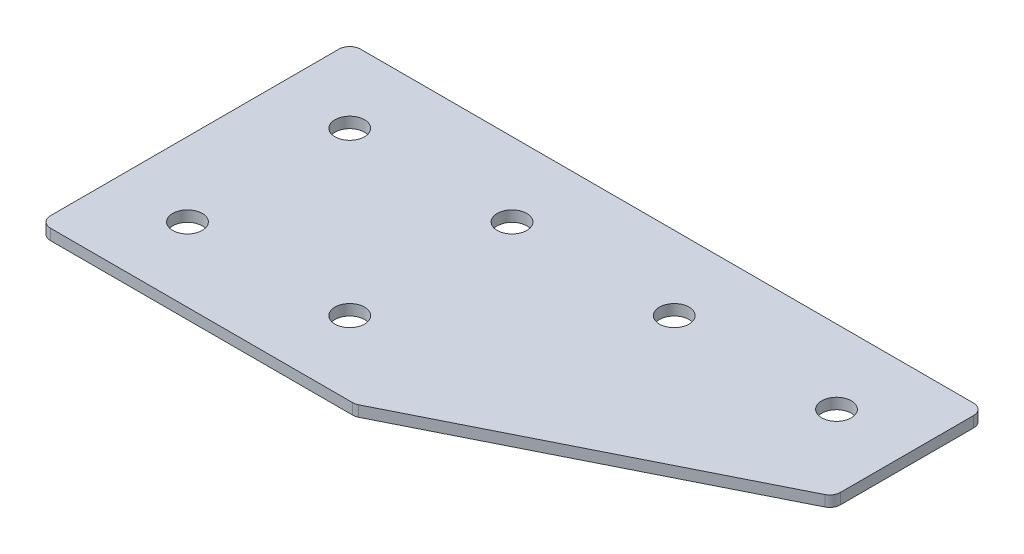
ISO-10303-21;
HEADER;
FILE_DESCRIPTION(('STEP AP214'),'2;1');
FILE_NAME('part.step','',(''),(''),'','','');
FILE_SCHEMA(('AUTOMOTIVE_DESIGN { 1 0 10303 214 1 1 1 1 }'));
ENDSEC;
DATA;
#1=APPLICATION_CONTEXT('core data for automotive mechanical design processes');
#2=APPLICATION_PROTOCOL_DEFINITION('international standard','automotive_design',2000,#1);
#3=PRODUCT_CONTEXT('',#1,'mechanical');
#4=PRODUCT('Part','Part','',(#3));
#5=PRODUCT_RELATED_PRODUCT_CATEGORY('part','',(#4));
#6=PRODUCT_DEFINITION_FORMATION('','',#4);
#7=PRODUCT_DEFINITION_CONTEXT('part definition',#1,'design');
#8=PRODUCT_DEFINITION('design','',#6,#7);
#9=PRODUCT_DEFINITION_SHAPE('','',#8);
#10=(LENGTH_UNIT() NAMED_UNIT(*) SI_UNIT(.MILLI.,.METRE.));
#11=(NAMED_UNIT(*) PLANE_ANGLE_UNIT() SI_UNIT($,.RADIAN.));
#12=(NAMED_UNIT(*) SI_UNIT($,.STERADIAN.) SOLID_ANGLE_UNIT());
#13=UNCERTAINTY_MEASURE_WITH_UNIT(LENGTH_MEASURE(1.E-05),#10,'distance_accuracy_value','');
#14=(GEOMETRIC_REPRESENTATION_CONTEXT(3) GLOBAL_UNCERTAINTY_ASSIGNED_CONTEXT((#13)) GLOBAL_UNIT_ASSIGNED_CONTEXT((#10,
#11,#12)) REPRESENTATION_CONTEXT('',''));
#15=CARTESIAN_POINT('',(0.,0.,0.));
#16=DIRECTION('',(0.,0.,1.));
#17=DIRECTION('',(1.,0.,0.));
#18=AXIS2_PLACEMENT_3D('',#15,#16,#17);
#19=CARTESIAN_POINT('',(-46.5618146076689,1.42462627726309,-23.8623363744272));
#20=DIRECTION('',(0.,-1.,0.));
#21=DIRECTION('',(0.,0.,-1.));
#22=AXIS2_PLACEMENT_3D('',#19,#20,#21);
#23=PLANE('',#22);
#24=CARTESIAN_POINT('',(-24.0618146076689,1.42462627726309,21.1376636255728));
#25=DIRECTION('',(0.,1.,0.));
#26=DIRECTION('',(0.,0.,1.));
#27=AXIS2_PLACEMENT_3D('',#24,#25,#26);
#28=CIRCLE('',#27,4.1);
#29=CARTESIAN_POINT('',(-24.0618146076689,1.42462627726309,25.2376636255728));
#30=VERTEX_POINT('',#29);
#31=EDGE_CURVE('E251',#30,#30,#28,.T.);
#32=ORIENTED_EDGE('',*,*,#31,.T.);
#33=EDGE_LOOP('',(#32));
#34=FACE_BOUND('',#33,.T.);
#35=CARTESIAN_POINT('',(-69.0618146076689,1.42462627726309,21.1376636255728));
#36=DIRECTION('',(0.,1.,0.));
#37=DIRECTION('',(0.,0.,1.));
#38=AXIS2_PLACEMENT_3D('',#35,#36,#37);
#39=CIRCLE('',#38,4.1);
#40=CARTESIAN_POINT('',(-69.0618146076689,1.42462627726309,25.2376636255728));
#41=VERTEX_POINT('',#40);
#42=EDGE_CURVE('E259',#41,#41,#39,.T.);
#43=ORIENTED_EDGE('',*,*,#42,.T.);
#44=EDGE_LOOP('',(#43));
#45=FACE_BOUND('',#44,.T.);
#46=CARTESIAN_POINT('',(65.9381853923311,1.42462627726309,-23.8623363744272));
#47=DIRECTION('',(0.,1.,0.));
#48=DIRECTION('',(0.,0.,1.));
#49=AXIS2_PLACEMENT_3D('',#46,#47,#48);
#50=CIRCLE('',#49,4.1);
#51=CARTESIAN_POINT('',(65.9381853923311,1.42462627726309,-19.7623363744272));
#52=VERTEX_POINT('',#51);
#53=EDGE_CURVE('E265',#52,#52,#50,.T.);
#54=ORIENTED_EDGE('',*,*,#53,.T.);
#55=EDGE_LOOP('',(#54));
#56=FACE_BOUND('',#55,.T.);
#57=CARTESIAN_POINT('',(20.9381853923311,1.42462627726309,-23.8623363744272));
#58=DIRECTION('',(0.,1.,0.));
#59=DIRECTION('',(0.,0.,1.));
#60=AXIS2_PLACEMENT_3D('',#57,#58,#59);
#61=CIRCLE('',#60,4.09999999999999);
#62=CARTESIAN_POINT('',(20.9381853923311,1.42462627726309,-19.7623363744273));
#63=VERTEX_POINT('',#62);
#64=EDGE_CURVE('E271',#63,#63,#61,.T.);
#65=ORIENTED_EDGE('',*,*,#64,.T.);
#66=EDGE_LOOP('',(#65));
#67=FACE_BOUND('',#66,.T.);
#68=CARTESIAN_POINT('',(-24.0618146076689,1.42462627726309,-23.8623363744272));
#69=DIRECTION('',(0.,1.,0.));
#70=DIRECTION('',(0.,0.,1.));
#71=AXIS2_PLACEMENT_3D('',#68,#69,#70);
#72=CIRCLE('',#71,4.1);
#73=CARTESIAN_POINT('',(-24.0618146076689,1.42462627726309,-19.7623363744272));
#74=VERTEX_POINT('',#73);
#75=EDGE_CURVE('E277',#74,#74,#72,.T.);
#76=ORIENTED_EDGE('',*,*,#75,.T.);
#77=EDGE_LOOP('',(#76));
#78=FACE_BOUND('',#77,.T.);
#79=CARTESIAN_POINT('',(-69.0618146076689,1.42462627726309,-23.8623363744272));
#80=DIRECTION('',(0.,1.,0.));
#81=DIRECTION('',(0.,0.,1.));
#82=AXIS2_PLACEMENT_3D('',#79,#80,#81);
#83=CIRCLE('',#82,4.1);
#84=CARTESIAN_POINT('',(-69.0618146076689,1.42462627726309,-19.7623363744272));
#85=VERTEX_POINT('',#84);
#86=EDGE_CURVE('E175',#85,#85,#83,.T.);
#87=ORIENTED_EDGE('',*,*,#86,.T.);
#88=EDGE_LOOP('',(#87));
#89=FACE_BOUND('',#88,.T.);
#90=DIRECTION('',(1.,0.,0.));
#91=VECTOR('',#90,1.);
#92=CARTESIAN_POINT('',(-89.561814607669,1.42462627726309,41.6376636255727));
#93=LINE('',#92,#91);
#94=CARTESIAN_POINT('',(-86.561814607669,1.42462627726309,41.6376636255727));
#95=VERTEX_POINT('',#94);
#96=CARTESIAN_POINT('',(-2.74215449516777,1.42462627726309,41.6376636255727));
#97=VERTEX_POINT('',#96);
#98=EDGE_CURVE('E121',#95,#97,#93,.T.);
#99=ORIENTED_EDGE('',*,*,#98,.F.);
#100=CARTESIAN_POINT('',(-86.561814607669,1.42462627726309,38.6376636255727));
#101=DIRECTION('',(0.,-1.,0.));
#102=DIRECTION('',(0.,0.,-1.));
#103=AXIS2_PLACEMENT_3D('',#100,#101,#102);
#104=CIRCLE('',#103,3.);
#105=CARTESIAN_POINT('',(-89.561814607669,1.42462627726309,38.6376636255727));
#106=VERTEX_POINT('',#105);
#107=EDGE_CURVE('E145',#95,#106,#104,.T.);
#108=ORIENTED_EDGE('',*,*,#107,.T.);
#109=DIRECTION('',(0.,0.,1.));
#110=VECTOR('',#109,1.);
#111=CARTESIAN_POINT('',(-89.561814607669,1.42462627726309,-44.3623363744273));
#112=LINE('',#111,#110);
#113=CARTESIAN_POINT('',(-89.561814607669,1.42462627726309,-41.3623363744273));
#114=VERTEX_POINT('',#113);
#115=EDGE_CURVE('E162',#114,#106,#112,.T.);
#116=ORIENTED_EDGE('',*,*,#115,.F.);
#117=CARTESIAN_POINT('',(-86.561814607669,1.42462627726309,-41.3623363744273));
#118=DIRECTION('',(0.,-1.,0.));
#119=DIRECTION('',(0.,0.,-1.));
#120=AXIS2_PLACEMENT_3D('',#117,#118,#119);
#121=CIRCLE('',#120,3.);
#122=CARTESIAN_POINT('',(-86.561814607669,1.42462627726309,-44.3623363744273));
#123=VERTEX_POINT('',#122);
#124=EDGE_CURVE('E117',#114,#123,#121,.T.);
#125=ORIENTED_EDGE('',*,*,#124,.T.);
#126=DIRECTION('',(-1.,0.,0.));
#127=VECTOR('',#126,1.);
#128=CARTESIAN_POINT('',(86.438185392331,1.42462627726309,-44.3623363744273));
#129=LINE('',#128,#127);
#130=CARTESIAN_POINT('',(83.438185392331,1.42462627726309,-44.3623363744273));
#131=VERTEX_POINT('',#130);
#132=EDGE_CURVE('E160',#131,#123,#129,.T.);
#133=ORIENTED_EDGE('',*,*,#132,.F.);
#134=CARTESIAN_POINT('',(83.438185392331,1.42462627726309,-41.3623363744273));
#135=DIRECTION('',(0.,-1.,0.));
#136=DIRECTION('',(0.,0.,-1.));
#137=AXIS2_PLACEMENT_3D('',#134,#135,#136);
#138=CIRCLE('',#137,3.);
#139=CARTESIAN_POINT('',(86.438185392331,1.42462627726309,-41.3623363744273));
#140=VERTEX_POINT('',#139);
#141=EDGE_CURVE('E140',#131,#140,#138,.T.);
#142=ORIENTED_EDGE('',*,*,#141,.T.);
#143=DIRECTION('',(0.,0.,-1.));
#144=VECTOR('',#143,1.);
#145=CARTESIAN_POINT('',(86.438185392331,1.42462627726309,-2.59840435192698));
#146=LINE('',#145,#144);
#147=CARTESIAN_POINT('',(86.438185392331,1.42462627726309,-4.45250631817667));
#148=VERTEX_POINT('',#147);
#149=EDGE_CURVE('E163',#148,#140,#146,.T.);
#150=ORIENTED_EDGE('',*,*,#149,.F.);
#151=CARTESIAN_POINT('',(83.438185392331,1.42462627726309,-4.45250631817667));
#152=DIRECTION('',(0.,-1.,0.));
#153=DIRECTION('',(0.,0.,-1.));
#154=AXIS2_PLACEMENT_3D('',#151,#152,#153);
#155=CIRCLE('',#154,3.);
#156=CARTESIAN_POINT('',(84.7798261788308,1.42462627726309,-1.76922474517691));
#157=VERTEX_POINT('',#156);
#158=EDGE_CURVE('E31',#148,#157,#155,.T.);
#159=ORIENTED_EDGE('',*,*,#158,.T.);
#160=DIRECTION('',(0.894427190999916,0.,-0.447213595499958));
#161=VECTOR('',#160,1.);
#162=CARTESIAN_POINT('',(-2.0339505626684,1.42462627726309,41.6376636255727));
#163=LINE('',#162,#161);
#164=CARTESIAN_POINT('',(-1.40051370866789,1.42462627726309,41.3209451985725));
#165=VERTEX_POINT('',#164);
#166=EDGE_CURVE('E118',#165,#157,#163,.T.);
#167=ORIENTED_EDGE('',*,*,#166,.F.);
#168=CARTESIAN_POINT('',(-2.74215449516777,1.42462627726309,38.6376636255727));
#169=DIRECTION('',(0.,-1.,0.));
#170=DIRECTION('',(0.,0.,-1.));
#171=AXIS2_PLACEMENT_3D('',#168,#169,#170);
#172=CIRCLE('',#171,3.);
#173=EDGE_CURVE('E143',#165,#97,#172,.T.);
#174=ORIENTED_EDGE('',*,*,#173,.T.);
#175=EDGE_LOOP('',(#99,#108,#116,#125,#133,#142,#150,#159,#167,#174));
#176=FACE_BOUND('',#175,.T.);
#177=ADVANCED_FACE('F16',(#34,#45,#56,#67,#78,#89,#176),#23,.T.);
#178=CARTESIAN_POINT('',(86.438185392331,1.42462627726309,-2.59840435192698));
#179=DIRECTION('',(1.,0.,0.));
#180=DIRECTION('',(0.,0.,-1.));
#181=AXIS2_PLACEMENT_3D('',#178,#179,#180);
#182=PLANE('',#181);
#183=DIRECTION('',(0.,0.,-1.));
#184=VECTOR('',#183,1.);
#185=CARTESIAN_POINT('',(86.438185392331,4.42462627726309,-2.59840435192698));
#186=LINE('',#185,#184);
#187=CARTESIAN_POINT('',(86.438185392331,4.42462627726309,-4.45250631817667));
#188=VERTEX_POINT('',#187);
#189=CARTESIAN_POINT('',(86.438185392331,4.42462627726309,-41.3623363744273));
#190=VERTEX_POINT('',#189);
#191=EDGE_CURVE('E172',#188,#190,#186,.T.);
#192=ORIENTED_EDGE('',*,*,#191,.F.);
#193=DIRECTION('',(0.,1.,0.));
#194=VECTOR('',#193,1.);
#195=CARTESIAN_POINT('',(86.438185392331,1.42462627726309,-4.45250631817667));
#196=LINE('',#195,#194);
#197=EDGE_CURVE('E154',#188,#148,#196,.F.);
#198=ORIENTED_EDGE('',*,*,#197,.T.);
#199=ORIENTED_EDGE('',*,*,#149,.T.);
#200=DIRECTION('',(0.,1.,0.));
#201=VECTOR('',#200,1.);
#202=CARTESIAN_POINT('',(86.438185392331,1.42462627726309,-41.3623363744273));
#203=LINE('',#202,#201);
#204=EDGE_CURVE('E151',#140,#190,#203,.T.);
#205=ORIENTED_EDGE('',*,*,#204,.T.);
#206=EDGE_LOOP('',(#192,#198,#199,#205));
#207=FACE_BOUND('',#206,.T.);
#208=ADVANCED_FACE('F206',(#207),#182,.T.);
#209=CARTESIAN_POINT('',(-2.0339505626684,1.42462627726309,41.6376636255727));
#210=DIRECTION('',(0.447213595499958,0.,0.894427190999916));
#211=DIRECTION('',(0.894427190999916,0.,-0.447213595499958));
#212=AXIS2_PLACEMENT_3D('',#209,#210,#211);
#213=PLANE('',#212);
#214=DIRECTION('',(0.894427190999916,0.,-0.447213595499958));
#215=VECTOR('',#214,1.);
#216=CARTESIAN_POINT('',(-2.0339505626684,4.42462627726309,41.6376636255727));
#217=LINE('',#216,#215);
#218=CARTESIAN_POINT('',(-1.40051370866789,4.42462627726309,41.3209451985725));
#219=VERTEX_POINT('',#218);
#220=CARTESIAN_POINT('',(84.7798261788308,4.42462627726309,-1.76922474517691));
#221=VERTEX_POINT('',#220);
#222=EDGE_CURVE('E124',#219,#221,#217,.T.);
#223=ORIENTED_EDGE('',*,*,#222,.F.);
#224=DIRECTION('',(0.,1.,0.));
#225=VECTOR('',#224,1.);
#226=CARTESIAN_POINT('',(-1.40051370866789,1.42462627726309,41.3209451985725));
#227=LINE('',#226,#225);
#228=EDGE_CURVE('E38',#219,#165,#227,.F.);
#229=ORIENTED_EDGE('',*,*,#228,.T.);
#230=ORIENTED_EDGE('',*,*,#166,.T.);
#231=DIRECTION('',(0.,1.,0.));
#232=VECTOR('',#231,1.);
#233=CARTESIAN_POINT('',(84.7798261788308,1.42462627726309,-1.76922474517692));
#234=LINE('',#233,#232);
#235=EDGE_CURVE('E147',#157,#221,#234,.T.);
#236=ORIENTED_EDGE('',*,*,#235,.T.);
#237=EDGE_LOOP('',(#223,#229,#230,#236));
#238=FACE_BOUND('',#237,.T.);
#239=ADVANCED_FACE('F180',(#238),#213,.T.);
#240=CARTESIAN_POINT('',(-89.561814607669,1.42462627726309,41.6376636255727));
#241=DIRECTION('',(0.,0.,1.));
#242=DIRECTION('',(1.,0.,0.));
#243=AXIS2_PLACEMENT_3D('',#240,#241,#242);
#244=PLANE('',#243);
#245=DIRECTION('',(1.,0.,0.));
#246=VECTOR('',#245,1.);
#247=CARTESIAN_POINT('',(-89.561814607669,4.42462627726309,41.6376636255727));
#248=LINE('',#247,#246);
#249=CARTESIAN_POINT('',(-86.561814607669,4.42462627726309,41.6376636255727));
#250=VERTEX_POINT('',#249);
#251=CARTESIAN_POINT('',(-2.74215449516777,4.42462627726309,41.6376636255727));
#252=VERTEX_POINT('',#251);
#253=EDGE_CURVE('E114',#250,#252,#248,.T.);
#254=ORIENTED_EDGE('',*,*,#253,.F.);
#255=DIRECTION('',(0.,1.,0.));
#256=VECTOR('',#255,1.);
#257=CARTESIAN_POINT('',(-86.561814607669,1.42462627726309,41.6376636255727));
#258=LINE('',#257,#256);
#259=EDGE_CURVE('E137',#250,#95,#258,.F.);
#260=ORIENTED_EDGE('',*,*,#259,.T.);
#261=ORIENTED_EDGE('',*,*,#98,.T.);
#262=DIRECTION('',(0.,1.,0.));
#263=VECTOR('',#262,1.);
#264=CARTESIAN_POINT('',(-2.74215449516777,1.42462627726309,41.6376636255727));
#265=LINE('',#264,#263);
#266=EDGE_CURVE('E134',#97,#252,#265,.T.);
#267=ORIENTED_EDGE('',*,*,#266,.T.);
#268=EDGE_LOOP('',(#254,#260,#261,#267));
#269=FACE_BOUND('',#268,.T.);
#270=ADVANCED_FACE('F189',(#269),#244,.T.);
#271=CARTESIAN_POINT('',(-89.561814607669,1.42462627726309,-44.3623363744273));
#272=DIRECTION('',(-1.,0.,0.));
#273=DIRECTION('',(0.,0.,1.));
#274=AXIS2_PLACEMENT_3D('',#271,#272,#273);
#275=PLANE('',#274);
#276=ORIENTED_EDGE('',*,*,#115,.T.);
#277=DIRECTION('',(0.,1.,0.));
#278=VECTOR('',#277,1.);
#279=CARTESIAN_POINT('',(-89.561814607669,1.42462627726309,38.6376636255727));
#280=LINE('',#279,#278);
#281=CARTESIAN_POINT('',(-89.561814607669,4.42462627726309,38.6376636255727));
#282=VERTEX_POINT('',#281);
#283=EDGE_CURVE('E105',#106,#282,#280,.T.);
#284=ORIENTED_EDGE('',*,*,#283,.T.);
#285=DIRECTION('',(0.,0.,1.));
#286=VECTOR('',#285,1.);
#287=CARTESIAN_POINT('',(-89.561814607669,4.42462627726309,-44.3623363744273));
#288=LINE('',#287,#286);
#289=CARTESIAN_POINT('',(-89.561814607669,4.42462627726309,-41.3623363744273));
#290=VERTEX_POINT('',#289);
#291=EDGE_CURVE('E97',#290,#282,#288,.T.);
#292=ORIENTED_EDGE('',*,*,#291,.F.);
#293=DIRECTION('',(0.,1.,0.));
#294=VECTOR('',#293,1.);
#295=CARTESIAN_POINT('',(-89.561814607669,1.42462627726309,-41.3623363744273));
#296=LINE('',#295,#294);
#297=EDGE_CURVE('E111',#290,#114,#296,.F.);
#298=ORIENTED_EDGE('',*,*,#297,.T.);
#299=EDGE_LOOP('',(#276,#284,#292,#298));
#300=FACE_BOUND('',#299,.T.);
#301=ADVANCED_FACE('F110',(#300),#275,.T.);
#302=CARTESIAN_POINT('',(86.438185392331,1.42462627726309,-44.3623363744273));
#303=DIRECTION('',(0.,0.,-1.));
#304=DIRECTION('',(-1.,0.,0.));
#305=AXIS2_PLACEMENT_3D('',#302,#303,#304);
#306=PLANE('',#305);
#307=DIRECTION('',(-1.,0.,0.));
#308=VECTOR('',#307,1.);
#309=CARTESIAN_POINT('',(86.438185392331,4.42462627726309,-44.3623363744273));
#310=LINE('',#309,#308);
#311=CARTESIAN_POINT('',(83.438185392331,4.42462627726309,-44.3623363744273));
#312=VERTEX_POINT('',#311);
#313=CARTESIAN_POINT('',(-86.561814607669,4.42462627726309,-44.3623363744273));
#314=VERTEX_POINT('',#313);
#315=EDGE_CURVE('E99',#312,#314,#310,.T.);
#316=ORIENTED_EDGE('',*,*,#315,.F.);
#317=DIRECTION('',(0.,1.,0.));
#318=VECTOR('',#317,1.);
#319=CARTESIAN_POINT('',(83.438185392331,1.42462627726309,-44.3623363744273));
#320=LINE('',#319,#318);
#321=EDGE_CURVE('E10',#312,#131,#320,.F.);
#322=ORIENTED_EDGE('',*,*,#321,.T.);
#323=ORIENTED_EDGE('',*,*,#132,.T.);
#324=DIRECTION('',(0.,1.,0.));
#325=VECTOR('',#324,1.);
#326=CARTESIAN_POINT('',(-86.561814607669,1.42462627726309,-44.3623363744273));
#327=LINE('',#326,#325);
#328=EDGE_CURVE('E24',#123,#314,#327,.T.);
#329=ORIENTED_EDGE('',*,*,#328,.T.);
#330=EDGE_LOOP('',(#316,#322,#323,#329));
#331=FACE_BOUND('',#330,.T.);
#332=ADVANCED_FACE('F157',(#331),#306,.T.);
#333=CARTESIAN_POINT('',(-46.5618146076689,4.42462627726309,-23.8623363744272));
#334=DIRECTION('',(0.,-1.,0.));
#335=DIRECTION('',(0.,0.,-1.));
#336=AXIS2_PLACEMENT_3D('',#333,#334,#335);
#337=PLANE('',#336);
#338=CARTESIAN_POINT('',(-24.0618146076689,4.42462627726309,21.1376636255728));
#339=DIRECTION('',(0.,1.,0.));
#340=DIRECTION('',(0.,0.,1.));
#341=AXIS2_PLACEMENT_3D('',#338,#339,#340);
#342=CIRCLE('',#341,4.1);
#343=CARTESIAN_POINT('',(-24.0618146076689,4.42462627726309,25.2376636255728));
#344=VERTEX_POINT('',#343);
#345=EDGE_CURVE('E254',#344,#344,#342,.T.);
#346=ORIENTED_EDGE('',*,*,#345,.F.);
#347=EDGE_LOOP('',(#346));
#348=FACE_BOUND('',#347,.T.);
#349=CARTESIAN_POINT('',(-69.0618146076689,4.42462627726309,21.1376636255728));
#350=DIRECTION('',(0.,1.,0.));
#351=DIRECTION('',(0.,0.,1.));
#352=AXIS2_PLACEMENT_3D('',#349,#350,#351);
#353=CIRCLE('',#352,4.1);
#354=CARTESIAN_POINT('',(-69.0618146076689,4.42462627726309,25.2376636255728));
#355=VERTEX_POINT('',#354);
#356=EDGE_CURVE('E256',#355,#355,#353,.T.);
#357=ORIENTED_EDGE('',*,*,#356,.F.);
#358=EDGE_LOOP('',(#357));
#359=FACE_BOUND('',#358,.T.);
#360=CARTESIAN_POINT('',(65.9381853923311,4.42462627726309,-23.8623363744272));
#361=DIRECTION('',(0.,1.,0.));
#362=DIRECTION('',(0.,0.,1.));
#363=AXIS2_PLACEMENT_3D('',#360,#361,#362);
#364=CIRCLE('',#363,4.1);
#365=CARTESIAN_POINT('',(65.9381853923311,4.42462627726309,-19.7623363744272));
#366=VERTEX_POINT('',#365);
#367=EDGE_CURVE('E262',#366,#366,#364,.T.);
#368=ORIENTED_EDGE('',*,*,#367,.F.);
#369=EDGE_LOOP('',(#368));
#370=FACE_BOUND('',#369,.T.);
#371=CARTESIAN_POINT('',(20.9381853923311,4.42462627726309,-23.8623363744272));
#372=DIRECTION('',(0.,1.,0.));
#373=DIRECTION('',(0.,0.,1.));
#374=AXIS2_PLACEMENT_3D('',#371,#372,#373);
#375=CIRCLE('',#374,4.09999999999999);
#376=CARTESIAN_POINT('',(20.9381853923311,4.42462627726309,-19.7623363744273));
#377=VERTEX_POINT('',#376);
#378=EDGE_CURVE('E268',#377,#377,#375,.T.);
#379=ORIENTED_EDGE('',*,*,#378,.F.);
#380=EDGE_LOOP('',(#379));
#381=FACE_BOUND('',#380,.T.);
#382=CARTESIAN_POINT('',(-24.0618146076689,4.42462627726309,-23.8623363744272));
#383=DIRECTION('',(0.,1.,0.));
#384=DIRECTION('',(0.,0.,1.));
#385=AXIS2_PLACEMENT_3D('',#382,#383,#384);
#386=CIRCLE('',#385,4.1);
#387=CARTESIAN_POINT('',(-24.0618146076689,4.42462627726309,-19.7623363744272));
#388=VERTEX_POINT('',#387);
#389=EDGE_CURVE('E274',#388,#388,#386,.T.);
#390=ORIENTED_EDGE('',*,*,#389,.F.);
#391=EDGE_LOOP('',(#390));
#392=FACE_BOUND('',#391,.T.);
#393=CARTESIAN_POINT('',(-69.0618146076689,4.42462627726309,-23.8623363744272));
#394=DIRECTION('',(0.,1.,0.));
#395=DIRECTION('',(0.,0.,1.));
#396=AXIS2_PLACEMENT_3D('',#393,#394,#395);
#397=CIRCLE('',#396,4.1);
#398=CARTESIAN_POINT('',(-69.0618146076689,4.42462627726309,-19.7623363744272));
#399=VERTEX_POINT('',#398);
#400=EDGE_CURVE('E280',#399,#399,#397,.T.);
#401=ORIENTED_EDGE('',*,*,#400,.F.);
#402=EDGE_LOOP('',(#401));
#403=FACE_BOUND('',#402,.T.);
#404=ORIENTED_EDGE('',*,*,#291,.T.);
#405=CARTESIAN_POINT('',(-86.561814607669,4.42462627726309,38.6376636255727));
#406=DIRECTION('',(0.,-1.,0.));
#407=DIRECTION('',(0.,0.,-1.));
#408=AXIS2_PLACEMENT_3D('',#405,#406,#407);
#409=CIRCLE('',#408,3.);
#410=EDGE_CURVE('E132',#282,#250,#409,.F.);
#411=ORIENTED_EDGE('',*,*,#410,.T.);
#412=ORIENTED_EDGE('',*,*,#253,.T.);
#413=CARTESIAN_POINT('',(-2.74215449516777,4.42462627726309,38.6376636255727));
#414=DIRECTION('',(0.,-1.,0.));
#415=DIRECTION('',(0.,0.,-1.));
#416=AXIS2_PLACEMENT_3D('',#413,#414,#415);
#417=CIRCLE('',#416,3.);
#418=EDGE_CURVE('E130',#252,#219,#417,.F.);
#419=ORIENTED_EDGE('',*,*,#418,.T.);
#420=ORIENTED_EDGE('',*,*,#222,.T.);
#421=CARTESIAN_POINT('',(83.438185392331,4.42462627726309,-4.45250631817667));
#422=DIRECTION('',(0.,-1.,0.));
#423=DIRECTION('',(0.,0.,-1.));
#424=AXIS2_PLACEMENT_3D('',#421,#422,#423);
#425=CIRCLE('',#424,3.);
#426=EDGE_CURVE('E128',#221,#188,#425,.F.);
#427=ORIENTED_EDGE('',*,*,#426,.T.);
#428=ORIENTED_EDGE('',*,*,#191,.T.);
#429=CARTESIAN_POINT('',(83.438185392331,4.42462627726309,-41.3623363744273));
#430=DIRECTION('',(0.,-1.,0.));
#431=DIRECTION('',(0.,0.,-1.));
#432=AXIS2_PLACEMENT_3D('',#429,#430,#431);
#433=CIRCLE('',#432,3.);
#434=EDGE_CURVE('E104',#190,#312,#433,.F.);
#435=ORIENTED_EDGE('',*,*,#434,.T.);
#436=ORIENTED_EDGE('',*,*,#315,.T.);
#437=CARTESIAN_POINT('',(-86.561814607669,4.42462627726309,-41.3623363744273));
#438=DIRECTION('',(0.,-1.,0.));
#439=DIRECTION('',(0.,0.,-1.));
#440=AXIS2_PLACEMENT_3D('',#437,#438,#439);
#441=CIRCLE('',#440,3.);
#442=EDGE_CURVE('E94',#314,#290,#441,.F.);
#443=ORIENTED_EDGE('',*,*,#442,.T.);
#444=EDGE_LOOP('',(#404,#411,#412,#419,#420,#427,#428,#435,#436,#443));
#445=FACE_BOUND('',#444,.T.);
#446=ADVANCED_FACE('F96',(#348,#359,#370,#381,#392,#403,#445),#337,.F.);
#447=CARTESIAN_POINT('',(-86.561814607669,1.42462627726309,38.6376636255727));
#448=DIRECTION('',(0.,1.,0.));
#449=DIRECTION('',(0.,0.,1.));
#450=AXIS2_PLACEMENT_3D('',#447,#448,#449);
#451=CYLINDRICAL_SURFACE('',#450,3.);
#452=ORIENTED_EDGE('',*,*,#107,.F.);
#453=ORIENTED_EDGE('',*,*,#259,.F.);
#454=ORIENTED_EDGE('',*,*,#410,.F.);
#455=ORIENTED_EDGE('',*,*,#283,.F.);
#456=EDGE_LOOP('',(#452,#453,#454,#455));
#457=FACE_BOUND('',#456,.T.);
#458=ADVANCED_FACE('F192',(#457),#451,.T.);
#459=CARTESIAN_POINT('',(-2.74215449516777,1.42462627726309,38.6376636255727));
#460=DIRECTION('',(0.,1.,0.));
#461=DIRECTION('',(0.,0.,1.));
#462=AXIS2_PLACEMENT_3D('',#459,#460,#461);
#463=CYLINDRICAL_SURFACE('',#462,3.);
#464=ORIENTED_EDGE('',*,*,#173,.F.);
#465=ORIENTED_EDGE('',*,*,#228,.F.);
#466=ORIENTED_EDGE('',*,*,#418,.F.);
#467=ORIENTED_EDGE('',*,*,#266,.F.);
#468=EDGE_LOOP('',(#464,#465,#466,#467));
#469=FACE_BOUND('',#468,.T.);
#470=ADVANCED_FACE('F184',(#469),#463,.T.);
#471=CARTESIAN_POINT('',(83.438185392331,1.42462627726309,-4.45250631817667));
#472=DIRECTION('',(0.,1.,0.));
#473=DIRECTION('',(0.,0.,1.));
#474=AXIS2_PLACEMENT_3D('',#471,#472,#473);
#475=CYLINDRICAL_SURFACE('',#474,3.);
#476=ORIENTED_EDGE('',*,*,#158,.F.);
#477=ORIENTED_EDGE('',*,*,#197,.F.);
#478=ORIENTED_EDGE('',*,*,#426,.F.);
#479=ORIENTED_EDGE('',*,*,#235,.F.);
#480=EDGE_LOOP('',(#476,#477,#478,#479));
#481=FACE_BOUND('',#480,.T.);
#482=ADVANCED_FACE('F200',(#481),#475,.T.);
#483=CARTESIAN_POINT('',(83.438185392331,1.42462627726309,-41.3623363744273));
#484=DIRECTION('',(0.,1.,0.));
#485=DIRECTION('',(0.,0.,1.));
#486=AXIS2_PLACEMENT_3D('',#483,#484,#485);
#487=CYLINDRICAL_SURFACE('',#486,3.);
#488=ORIENTED_EDGE('',*,*,#141,.F.);
#489=ORIENTED_EDGE('',*,*,#321,.F.);
#490=ORIENTED_EDGE('',*,*,#434,.F.);
#491=ORIENTED_EDGE('',*,*,#204,.F.);
#492=EDGE_LOOP('',(#488,#489,#490,#491));
#493=FACE_BOUND('',#492,.T.);
#494=ADVANCED_FACE('F337',(#493),#487,.T.);
#495=CARTESIAN_POINT('',(-86.561814607669,1.42462627726309,-41.3623363744273));
#496=DIRECTION('',(0.,1.,0.));
#497=DIRECTION('',(0.,0.,1.));
#498=AXIS2_PLACEMENT_3D('',#495,#496,#497);
#499=CYLINDRICAL_SURFACE('',#498,3.);
#500=ORIENTED_EDGE('',*,*,#124,.F.);
#501=ORIENTED_EDGE('',*,*,#297,.F.);
#502=ORIENTED_EDGE('',*,*,#442,.F.);
#503=ORIENTED_EDGE('',*,*,#328,.F.);
#504=EDGE_LOOP('',(#500,#501,#502,#503));
#505=FACE_BOUND('',#504,.T.);
#506=ADVANCED_FACE('F18',(#505),#499,.T.);
#507=CARTESIAN_POINT('',(-69.0618146076689,1.42462627726309,-23.8623363744272));
#508=DIRECTION('',(0.,1.,0.));
#509=DIRECTION('',(0.,0.,1.));
#510=AXIS2_PLACEMENT_3D('',#507,#508,#509);
#511=CYLINDRICAL_SURFACE('',#510,4.1);
#512=ORIENTED_EDGE('',*,*,#86,.F.);
#513=EDGE_LOOP('',(#512));
#514=FACE_BOUND('',#513,.T.);
#515=ORIENTED_EDGE('',*,*,#400,.T.);
#516=EDGE_LOOP('',(#515));
#517=FACE_BOUND('',#516,.T.);
#518=ADVANCED_FACE('F224',(#514,#517),#511,.F.);
#519=CARTESIAN_POINT('',(-24.0618146076689,1.42462627726309,-23.8623363744272));
#520=DIRECTION('',(0.,1.,0.));
#521=DIRECTION('',(0.,0.,1.));
#522=AXIS2_PLACEMENT_3D('',#519,#520,#521);
#523=CYLINDRICAL_SURFACE('',#522,4.1);
#524=ORIENTED_EDGE('',*,*,#75,.F.);
#525=EDGE_LOOP('',(#524));
#526=FACE_BOUND('',#525,.T.);
#527=ORIENTED_EDGE('',*,*,#389,.T.);
#528=EDGE_LOOP('',(#527));
#529=FACE_BOUND('',#528,.T.);
#530=ADVANCED_FACE('F227',(#526,#529),#523,.F.);
#531=CARTESIAN_POINT('',(20.9381853923311,1.42462627726309,-23.8623363744272));
#532=DIRECTION('',(0.,1.,0.));
#533=DIRECTION('',(0.,0.,1.));
#534=AXIS2_PLACEMENT_3D('',#531,#532,#533);
#535=CYLINDRICAL_SURFACE('',#534,4.09999999999999);
#536=ORIENTED_EDGE('',*,*,#64,.F.);
#537=EDGE_LOOP('',(#536));
#538=FACE_BOUND('',#537,.T.);
#539=ORIENTED_EDGE('',*,*,#378,.T.);
#540=EDGE_LOOP('',(#539));
#541=FACE_BOUND('',#540,.T.);
#542=ADVANCED_FACE('F231',(#538,#541),#535,.F.);
#543=CARTESIAN_POINT('',(65.9381853923311,1.42462627726309,-23.8623363744272));
#544=DIRECTION('',(0.,1.,0.));
#545=DIRECTION('',(0.,0.,1.));
#546=AXIS2_PLACEMENT_3D('',#543,#544,#545);
#547=CYLINDRICAL_SURFACE('',#546,4.1);
#548=ORIENTED_EDGE('',*,*,#53,.F.);
#549=EDGE_LOOP('',(#548));
#550=FACE_BOUND('',#549,.T.);
#551=ORIENTED_EDGE('',*,*,#367,.T.);
#552=EDGE_LOOP('',(#551));
#553=FACE_BOUND('',#552,.T.);
#554=ADVANCED_FACE('F235',(#550,#553),#547,.F.);
#555=CARTESIAN_POINT('',(-69.0618146076689,1.42462627726309,21.1376636255728));
#556=DIRECTION('',(0.,1.,0.));
#557=DIRECTION('',(0.,0.,1.));
#558=AXIS2_PLACEMENT_3D('',#555,#556,#557);
#559=CYLINDRICAL_SURFACE('',#558,4.1);
#560=ORIENTED_EDGE('',*,*,#42,.F.);
#561=EDGE_LOOP('',(#560));
#562=FACE_BOUND('',#561,.T.);
#563=ORIENTED_EDGE('',*,*,#356,.T.);
#564=EDGE_LOOP('',(#563));
#565=FACE_BOUND('',#564,.T.);
#566=ADVANCED_FACE('F239',(#562,#565),#559,.F.);
#567=CARTESIAN_POINT('',(-24.0618146076689,1.42462627726309,21.1376636255728));
#568=DIRECTION('',(0.,1.,0.));
#569=DIRECTION('',(0.,0.,1.));
#570=AXIS2_PLACEMENT_3D('',#567,#568,#569);
#571=CYLINDRICAL_SURFACE('',#570,4.1);
#572=ORIENTED_EDGE('',*,*,#31,.F.);
#573=EDGE_LOOP('',(#572));
#574=FACE_BOUND('',#573,.T.);
#575=ORIENTED_EDGE('',*,*,#345,.T.);
#576=EDGE_LOOP('',(#575));
#577=FACE_BOUND('',#576,.T.);
#578=ADVANCED_FACE('F243',(#574,#577),#571,.F.);
#579=CLOSED_SHELL('',(#177,#208,#239,#270,#301,#332,#446,#458,#470,#482,#494,#506,#518,#530,
#542,#554,#566,#578));
#580=MANIFOLD_SOLID_BREP('B1',#579);
#581=ADVANCED_BREP_SHAPE_REPRESENTATION('',(#18,#580),#14);
#582=SHAPE_DEFINITION_REPRESENTATION(#9,#581);
ENDSEC;
END-ISO-10303-21;
